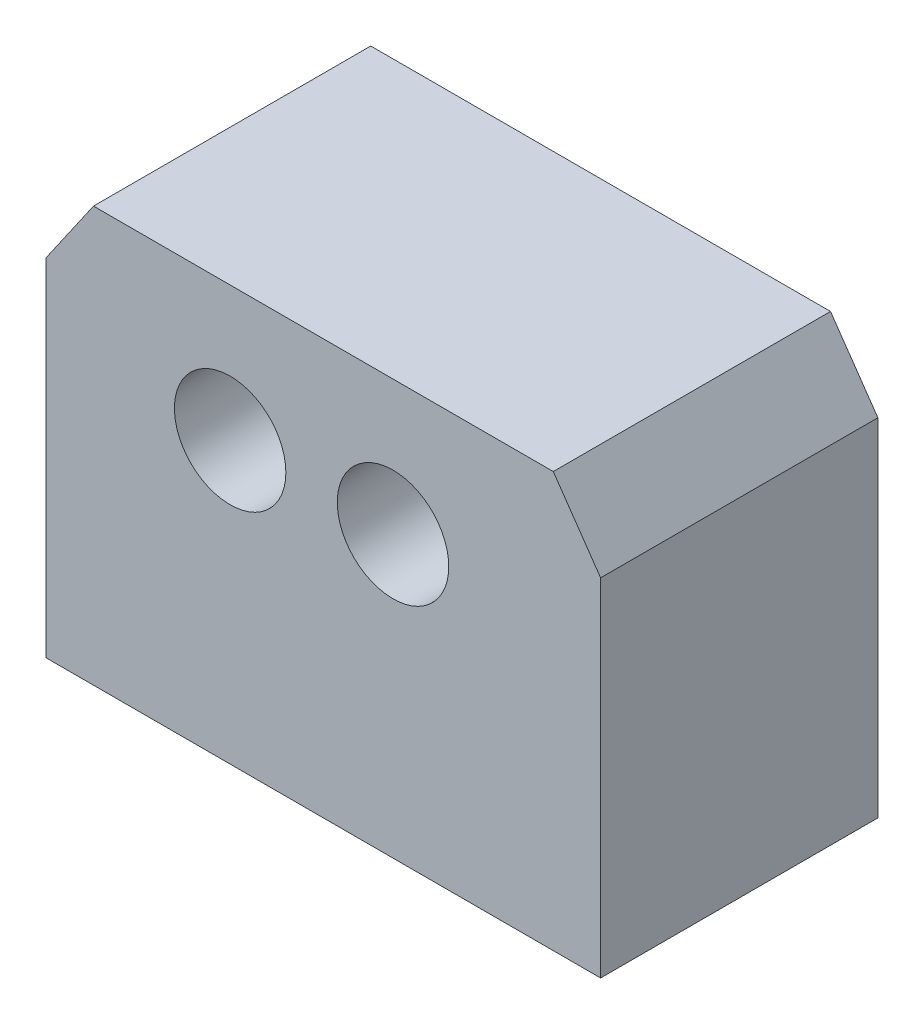
ISO-10303-21;
HEADER;
FILE_DESCRIPTION(('STEP AP214'),'2;1');
FILE_NAME('part.step','',(''),(''),'','','');
FILE_SCHEMA(('AUTOMOTIVE_DESIGN { 1 0 10303 214 1 1 1 1 }'));
ENDSEC;
DATA;
#1=APPLICATION_CONTEXT('core data for automotive mechanical design processes');
#2=APPLICATION_PROTOCOL_DEFINITION('international standard','automotive_design',2000,#1);
#3=PRODUCT_CONTEXT('',#1,'mechanical');
#4=PRODUCT('Part','Part','',(#3));
#5=PRODUCT_RELATED_PRODUCT_CATEGORY('part','',(#4));
#6=PRODUCT_DEFINITION_FORMATION('','',#4);
#7=PRODUCT_DEFINITION_CONTEXT('part definition',#1,'design');
#8=PRODUCT_DEFINITION('design','',#6,#7);
#9=PRODUCT_DEFINITION_SHAPE('','',#8);
#10=(LENGTH_UNIT() NAMED_UNIT(*) SI_UNIT(.MILLI.,.METRE.));
#11=(NAMED_UNIT(*) PLANE_ANGLE_UNIT() SI_UNIT($,.RADIAN.));
#12=(NAMED_UNIT(*) SI_UNIT($,.STERADIAN.) SOLID_ANGLE_UNIT());
#13=UNCERTAINTY_MEASURE_WITH_UNIT(LENGTH_MEASURE(1.E-05),#10,'distance_accuracy_value','');
#14=(GEOMETRIC_REPRESENTATION_CONTEXT(3) GLOBAL_UNCERTAINTY_ASSIGNED_CONTEXT((#13)) GLOBAL_UNIT_ASSIGNED_CONTEXT((#10,
#11,#12)) REPRESENTATION_CONTEXT('',''));
#15=CARTESIAN_POINT('',(0.,0.,0.));
#16=DIRECTION('',(0.,0.,1.));
#17=DIRECTION('',(1.,0.,0.));
#18=AXIS2_PLACEMENT_3D('',#15,#16,#17);
#19=CARTESIAN_POINT('',(0.,0.,20.));
#20=DIRECTION('',(0.,0.,-1.));
#21=DIRECTION('',(-1.,0.,0.));
#22=AXIS2_PLACEMENT_3D('',#19,#20,#21);
#23=PLANE('',#22);
#24=DIRECTION('',(0.,1.,0.));
#25=VECTOR('',#24,1.);
#26=CARTESIAN_POINT('',(19.9063015288218,-10.2223940246417,20.));
#27=LINE('',#26,#25);
#28=CARTESIAN_POINT('',(19.9063015288218,-20.2223940246417,20.));
#29=VERTEX_POINT('',#28);
#30=CARTESIAN_POINT('',(19.9063015288218,4.77760597535826,20.));
#31=VERTEX_POINT('',#30);
#32=EDGE_CURVE('E104',#29,#31,#27,.T.);
#33=ORIENTED_EDGE('',*,*,#32,.T.);
#34=DIRECTION('',(-0.569413380398006,0.822051337948985,0.));
#35=VECTOR('',#34,1.);
#36=CARTESIAN_POINT('',(16.4898212464338,9.70991400305216,20.));
#37=LINE('',#36,#35);
#38=CARTESIAN_POINT('',(16.4898212464338,9.70991400305216,20.));
#39=VERTEX_POINT('',#38);
#40=EDGE_CURVE('E81',#31,#39,#37,.T.);
#41=ORIENTED_EDGE('',*,*,#40,.T.);
#42=DIRECTION('',(-1.,0.,0.));
#43=VECTOR('',#42,1.);
#44=CARTESIAN_POINT('',(-16.6772181887901,9.70991400305216,20.));
#45=LINE('',#44,#43);
#46=CARTESIAN_POINT('',(-16.6772181887901,9.70991400305216,20.));
#47=VERTEX_POINT('',#46);
#48=EDGE_CURVE('E139',#39,#47,#45,.T.);
#49=ORIENTED_EDGE('',*,*,#48,.T.);
#50=DIRECTION('',(-0.569413380398007,-0.822051337948984,0.));
#51=VECTOR('',#50,1.);
#52=CARTESIAN_POINT('',(-20.0936984711782,4.77760597535826,20.));
#53=LINE('',#52,#51);
#54=CARTESIAN_POINT('',(-20.0936984711782,4.77760597535826,20.));
#55=VERTEX_POINT('',#54);
#56=EDGE_CURVE('E50',#47,#55,#53,.T.);
#57=ORIENTED_EDGE('',*,*,#56,.T.);
#58=DIRECTION('',(0.,-1.,0.));
#59=VECTOR('',#58,1.);
#60=CARTESIAN_POINT('',(-20.0936984711782,-10.2223940246417,20.));
#61=LINE('',#60,#59);
#62=CARTESIAN_POINT('',(-20.0936984711782,-20.2223940246417,20.));
#63=VERTEX_POINT('',#62);
#64=EDGE_CURVE('E142',#55,#63,#61,.T.);
#65=ORIENTED_EDGE('',*,*,#64,.T.);
#66=DIRECTION('',(-1.,0.,0.));
#67=VECTOR('',#66,1.);
#68=CARTESIAN_POINT('',(-20.0936984711782,-20.2223940246417,20.));
#69=LINE('',#68,#67);
#70=EDGE_CURVE('E120',#29,#63,#69,.T.);
#71=ORIENTED_EDGE('',*,*,#70,.F.);
#72=EDGE_LOOP('',(#33,#41,#49,#57,#65,#71));
#73=FACE_BOUND('',#72,.T.);
#74=CARTESIAN_POINT('',(-6.81990499799709,0.,20.));
#75=DIRECTION('',(0.,0.,1.));
#76=DIRECTION('',(1.,0.,0.));
#77=AXIS2_PLACEMENT_3D('',#74,#75,#76);
#78=CIRCLE('',#77,4.02029722744518);
#79=CARTESIAN_POINT('',(-2.79960777055191,0.,20.));
#80=VERTEX_POINT('',#79);
#81=EDGE_CURVE('E132',#80,#80,#78,.T.);
#82=ORIENTED_EDGE('',*,*,#81,.F.);
#83=EDGE_LOOP('',(#82));
#84=FACE_BOUND('',#83,.T.);
#85=CARTESIAN_POINT('',(4.93009500200291,0.,20.));
#86=DIRECTION('',(0.,0.,1.));
#87=DIRECTION('',(1.,0.,0.));
#88=AXIS2_PLACEMENT_3D('',#85,#86,#87);
#89=CIRCLE('',#88,4.02029722744518);
#90=CARTESIAN_POINT('',(8.95039222944809,0.,20.));
#91=VERTEX_POINT('',#90);
#92=EDGE_CURVE('E126',#91,#91,#89,.T.);
#93=ORIENTED_EDGE('',*,*,#92,.F.);
#94=EDGE_LOOP('',(#93));
#95=FACE_BOUND('',#94,.T.);
#96=ADVANCED_FACE('F33',(#73,#84,#95),#23,.F.);
#97=CARTESIAN_POINT('',(0.,0.,0.));
#98=DIRECTION('',(0.,0.,-1.));
#99=DIRECTION('',(-1.,0.,0.));
#100=AXIS2_PLACEMENT_3D('',#97,#98,#99);
#101=PLANE('',#100);
#102=CARTESIAN_POINT('',(-6.81990499799709,0.,0.));
#103=DIRECTION('',(0.,0.,1.));
#104=DIRECTION('',(1.,0.,0.));
#105=AXIS2_PLACEMENT_3D('',#102,#103,#104);
#106=CIRCLE('',#105,4.02029722744518);
#107=CARTESIAN_POINT('',(-2.79960777055191,0.,0.));
#108=VERTEX_POINT('',#107);
#109=EDGE_CURVE('E129',#108,#108,#106,.T.);
#110=ORIENTED_EDGE('',*,*,#109,.T.);
#111=EDGE_LOOP('',(#110));
#112=FACE_BOUND('',#111,.T.);
#113=DIRECTION('',(0.,1.,0.));
#114=VECTOR('',#113,1.);
#115=CARTESIAN_POINT('',(19.9063015288218,-10.2223940246417,0.));
#116=LINE('',#115,#114);
#117=CARTESIAN_POINT('',(19.9063015288218,-20.2223940246417,0.));
#118=VERTEX_POINT('',#117);
#119=CARTESIAN_POINT('',(19.9063015288218,4.77760597535826,0.));
#120=VERTEX_POINT('',#119);
#121=EDGE_CURVE('E111',#118,#120,#116,.T.);
#122=ORIENTED_EDGE('',*,*,#121,.F.);
#123=DIRECTION('',(1.,0.,0.));
#124=VECTOR('',#123,1.);
#125=CARTESIAN_POINT('',(-20.0936984711782,-20.2223940246417,0.));
#126=LINE('',#125,#124);
#127=CARTESIAN_POINT('',(-20.0936984711782,-20.2223940246417,0.));
#128=VERTEX_POINT('',#127);
#129=EDGE_CURVE('E107',#128,#118,#126,.T.);
#130=ORIENTED_EDGE('',*,*,#129,.F.);
#131=DIRECTION('',(0.,-1.,0.));
#132=VECTOR('',#131,1.);
#133=CARTESIAN_POINT('',(-20.0936984711782,-10.2223940246417,0.));
#134=LINE('',#133,#132);
#135=CARTESIAN_POINT('',(-20.0936984711782,4.77760597535826,0.));
#136=VERTEX_POINT('',#135);
#137=EDGE_CURVE('E96',#136,#128,#134,.T.);
#138=ORIENTED_EDGE('',*,*,#137,.F.);
#139=DIRECTION('',(-0.569413380398007,-0.822051337948984,0.));
#140=VECTOR('',#139,1.);
#141=CARTESIAN_POINT('',(-20.0936984711782,4.77760597535826,0.));
#142=LINE('',#141,#140);
#143=CARTESIAN_POINT('',(-16.6772181887901,9.70991400305216,0.));
#144=VERTEX_POINT('',#143);
#145=EDGE_CURVE('E74',#144,#136,#142,.T.);
#146=ORIENTED_EDGE('',*,*,#145,.F.);
#147=DIRECTION('',(-1.,0.,0.));
#148=VECTOR('',#147,1.);
#149=CARTESIAN_POINT('',(-16.6772181887901,9.70991400305216,0.));
#150=LINE('',#149,#148);
#151=CARTESIAN_POINT('',(16.4898212464338,9.70991400305216,0.));
#152=VERTEX_POINT('',#151);
#153=EDGE_CURVE('E68',#152,#144,#150,.T.);
#154=ORIENTED_EDGE('',*,*,#153,.F.);
#155=DIRECTION('',(-0.569413380398006,0.822051337948985,0.));
#156=VECTOR('',#155,1.);
#157=CARTESIAN_POINT('',(16.4898212464338,9.70991400305216,0.));
#158=LINE('',#157,#156);
#159=EDGE_CURVE('E145',#120,#152,#158,.T.);
#160=ORIENTED_EDGE('',*,*,#159,.F.);
#161=EDGE_LOOP('',(#122,#130,#138,#146,#154,#160));
#162=FACE_BOUND('',#161,.T.);
#163=CARTESIAN_POINT('',(4.93009500200291,0.,0.));
#164=DIRECTION('',(0.,0.,1.));
#165=DIRECTION('',(1.,0.,0.));
#166=AXIS2_PLACEMENT_3D('',#163,#164,#165);
#167=CIRCLE('',#166,4.02029722744518);
#168=CARTESIAN_POINT('',(8.95039222944809,0.,0.));
#169=VERTEX_POINT('',#168);
#170=EDGE_CURVE('E125',#169,#169,#167,.T.);
#171=ORIENTED_EDGE('',*,*,#170,.T.);
#172=EDGE_LOOP('',(#171));
#173=FACE_BOUND('',#172,.T.);
#174=ADVANCED_FACE('F108',(#112,#162,#173),#101,.T.);
#175=CARTESIAN_POINT('',(19.9063015288218,-10.2223940246417,20.));
#176=DIRECTION('',(-1.,0.,0.));
#177=DIRECTION('',(0.,0.,1.));
#178=AXIS2_PLACEMENT_3D('',#175,#176,#177);
#179=PLANE('',#178);
#180=ORIENTED_EDGE('',*,*,#121,.T.);
#181=DIRECTION('',(0.,0.,-1.));
#182=VECTOR('',#181,1.);
#183=CARTESIAN_POINT('',(19.9063015288218,4.77760597535826,20.));
#184=LINE('',#183,#182);
#185=EDGE_CURVE('E11',#31,#120,#184,.T.);
#186=ORIENTED_EDGE('',*,*,#185,.F.);
#187=ORIENTED_EDGE('',*,*,#32,.F.);
#188=DIRECTION('',(0.,0.,1.));
#189=VECTOR('',#188,1.);
#190=CARTESIAN_POINT('',(19.9063015288218,-20.2223940246417,20.));
#191=LINE('',#190,#189);
#192=EDGE_CURVE('E115',#118,#29,#191,.T.);
#193=ORIENTED_EDGE('',*,*,#192,.F.);
#194=EDGE_LOOP('',(#180,#186,#187,#193));
#195=FACE_BOUND('',#194,.T.);
#196=ADVANCED_FACE('F35',(#195),#179,.F.);
#197=CARTESIAN_POINT('',(16.4898212464338,9.70991400305216,20.));
#198=DIRECTION('',(-0.822051337948985,-0.569413380398006,0.));
#199=DIRECTION('',(0.569413380398006,-0.822051337948985,0.));
#200=AXIS2_PLACEMENT_3D('',#197,#198,#199);
#201=PLANE('',#200);
#202=ORIENTED_EDGE('',*,*,#159,.T.);
#203=DIRECTION('',(0.,0.,-1.));
#204=VECTOR('',#203,1.);
#205=CARTESIAN_POINT('',(16.4898212464338,9.70991400305216,20.));
#206=LINE('',#205,#204);
#207=EDGE_CURVE('E42',#39,#152,#206,.T.);
#208=ORIENTED_EDGE('',*,*,#207,.F.);
#209=ORIENTED_EDGE('',*,*,#40,.F.);
#210=ORIENTED_EDGE('',*,*,#185,.T.);
#211=EDGE_LOOP('',(#202,#208,#209,#210));
#212=FACE_BOUND('',#211,.T.);
#213=ADVANCED_FACE('F154',(#212),#201,.F.);
#214=CARTESIAN_POINT('',(-16.6772181887901,9.70991400305216,20.));
#215=DIRECTION('',(0.,-1.,0.));
#216=DIRECTION('',(1.,0.,0.));
#217=AXIS2_PLACEMENT_3D('',#214,#215,#216);
#218=PLANE('',#217);
#219=ORIENTED_EDGE('',*,*,#153,.T.);
#220=DIRECTION('',(0.,0.,-1.));
#221=VECTOR('',#220,1.);
#222=CARTESIAN_POINT('',(-16.6772181887901,9.70991400305216,20.));
#223=LINE('',#222,#221);
#224=EDGE_CURVE('E150',#47,#144,#223,.T.);
#225=ORIENTED_EDGE('',*,*,#224,.F.);
#226=ORIENTED_EDGE('',*,*,#48,.F.);
#227=ORIENTED_EDGE('',*,*,#207,.T.);
#228=EDGE_LOOP('',(#219,#225,#226,#227));
#229=FACE_BOUND('',#228,.T.);
#230=ADVANCED_FACE('F152',(#229),#218,.F.);
#231=CARTESIAN_POINT('',(-20.0936984711782,4.77760597535826,20.));
#232=DIRECTION('',(0.822051337948984,-0.569413380398007,0.));
#233=DIRECTION('',(0.569413380398007,0.822051337948984,0.));
#234=AXIS2_PLACEMENT_3D('',#231,#232,#233);
#235=PLANE('',#234);
#236=ORIENTED_EDGE('',*,*,#145,.T.);
#237=DIRECTION('',(0.,0.,-1.));
#238=VECTOR('',#237,1.);
#239=CARTESIAN_POINT('',(-20.0936984711782,4.77760597535826,20.));
#240=LINE('',#239,#238);
#241=EDGE_CURVE('E102',#55,#136,#240,.T.);
#242=ORIENTED_EDGE('',*,*,#241,.F.);
#243=ORIENTED_EDGE('',*,*,#56,.F.);
#244=ORIENTED_EDGE('',*,*,#224,.T.);
#245=EDGE_LOOP('',(#236,#242,#243,#244));
#246=FACE_BOUND('',#245,.T.);
#247=ADVANCED_FACE('F157',(#246),#235,.F.);
#248=CARTESIAN_POINT('',(-20.0936984711782,-10.2223940246417,20.));
#249=DIRECTION('',(1.,0.,0.));
#250=DIRECTION('',(0.,0.,-1.));
#251=AXIS2_PLACEMENT_3D('',#248,#249,#250);
#252=PLANE('',#251);
#253=ORIENTED_EDGE('',*,*,#137,.T.);
#254=DIRECTION('',(0.,0.,-1.));
#255=VECTOR('',#254,1.);
#256=CARTESIAN_POINT('',(-20.0936984711782,-20.2223940246417,20.));
#257=LINE('',#256,#255);
#258=EDGE_CURVE('E101',#63,#128,#257,.T.);
#259=ORIENTED_EDGE('',*,*,#258,.F.);
#260=ORIENTED_EDGE('',*,*,#64,.F.);
#261=ORIENTED_EDGE('',*,*,#241,.T.);
#262=EDGE_LOOP('',(#253,#259,#260,#261));
#263=FACE_BOUND('',#262,.T.);
#264=ADVANCED_FACE('F98',(#263),#252,.F.);
#265=CARTESIAN_POINT('',(-6.81990499799709,0.,20.));
#266=DIRECTION('',(0.,0.,-1.));
#267=DIRECTION('',(-1.,0.,0.));
#268=AXIS2_PLACEMENT_3D('',#265,#266,#267);
#269=CYLINDRICAL_SURFACE('',#268,4.02029722744518);
#270=ORIENTED_EDGE('',*,*,#81,.T.);
#271=EDGE_LOOP('',(#270));
#272=FACE_BOUND('',#271,.T.);
#273=ORIENTED_EDGE('',*,*,#109,.F.);
#274=EDGE_LOOP('',(#273));
#275=FACE_BOUND('',#274,.T.);
#276=ADVANCED_FACE('F164',(#272,#275),#269,.F.);
#277=CARTESIAN_POINT('',(4.93009500200291,0.,20.));
#278=DIRECTION('',(0.,0.,-1.));
#279=DIRECTION('',(-1.,0.,0.));
#280=AXIS2_PLACEMENT_3D('',#277,#278,#279);
#281=CYLINDRICAL_SURFACE('',#280,4.02029722744518);
#282=ORIENTED_EDGE('',*,*,#92,.T.);
#283=EDGE_LOOP('',(#282));
#284=FACE_BOUND('',#283,.T.);
#285=ORIENTED_EDGE('',*,*,#170,.F.);
#286=EDGE_LOOP('',(#285));
#287=FACE_BOUND('',#286,.T.);
#288=ADVANCED_FACE('F177',(#284,#287),#281,.F.);
#289=CARTESIAN_POINT('',(0.,-20.2223940246417,0.));
#290=DIRECTION('',(0.,-1.,0.));
#291=DIRECTION('',(0.,0.,-1.));
#292=AXIS2_PLACEMENT_3D('',#289,#290,#291);
#293=PLANE('',#292);
#294=ORIENTED_EDGE('',*,*,#258,.T.);
#295=ORIENTED_EDGE('',*,*,#129,.T.);
#296=ORIENTED_EDGE('',*,*,#192,.T.);
#297=ORIENTED_EDGE('',*,*,#70,.T.);
#298=EDGE_LOOP('',(#294,#295,#296,#297));
#299=FACE_BOUND('',#298,.T.);
#300=ADVANCED_FACE('F118',(#299),#293,.T.);
#301=CLOSED_SHELL('',(#96,#174,#196,#213,#230,#247,#264,#276,#288,#300));
#302=MANIFOLD_SOLID_BREP('B2',#301);
#303=ADVANCED_BREP_SHAPE_REPRESENTATION('',(#18,#302),#14);
#304=SHAPE_DEFINITION_REPRESENTATION(#9,#303);
ENDSEC;
END-ISO-10303-21;
